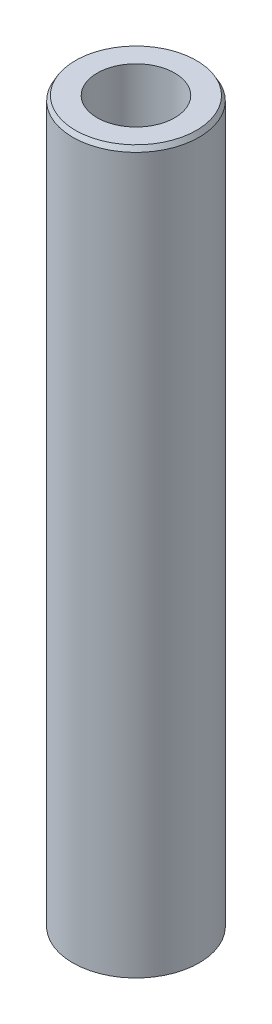
ISO-10303-21;
HEADER;
FILE_DESCRIPTION(('STEP AP214'),'2;1');
FILE_NAME('part.step','',(''),(''),'','','');
FILE_SCHEMA(('AUTOMOTIVE_DESIGN { 1 0 10303 214 1 1 1 1 }'));
ENDSEC;
DATA;
#1=APPLICATION_CONTEXT('core data for automotive mechanical design processes');
#2=APPLICATION_PROTOCOL_DEFINITION('international standard','automotive_design',2000,#1);
#3=PRODUCT_CONTEXT('',#1,'mechanical');
#4=PRODUCT('Part','Part','',(#3));
#5=PRODUCT_RELATED_PRODUCT_CATEGORY('part','',(#4));
#6=PRODUCT_DEFINITION_FORMATION('','',#4);
#7=PRODUCT_DEFINITION_CONTEXT('part definition',#1,'design');
#8=PRODUCT_DEFINITION('design','',#6,#7);
#9=PRODUCT_DEFINITION_SHAPE('','',#8);
#10=(LENGTH_UNIT() NAMED_UNIT(*) SI_UNIT(.MILLI.,.METRE.));
#11=(NAMED_UNIT(*) PLANE_ANGLE_UNIT() SI_UNIT($,.RADIAN.));
#12=(NAMED_UNIT(*) SI_UNIT($,.STERADIAN.) SOLID_ANGLE_UNIT());
#13=UNCERTAINTY_MEASURE_WITH_UNIT(LENGTH_MEASURE(1.E-05),#10,'distance_accuracy_value','');
#14=(GEOMETRIC_REPRESENTATION_CONTEXT(3) GLOBAL_UNCERTAINTY_ASSIGNED_CONTEXT((#13)) GLOBAL_UNIT_ASSIGNED_CONTEXT((#10,
#11,#12)) REPRESENTATION_CONTEXT('',''));
#15=CARTESIAN_POINT('',(0.,0.,0.));
#16=DIRECTION('',(0.,0.,1.));
#17=DIRECTION('',(1.,0.,0.));
#18=AXIS2_PLACEMENT_3D('',#15,#16,#17);
#19=CARTESIAN_POINT('',(0.,600.,0.));
#20=DIRECTION('',(0.,-1.,0.));
#21=DIRECTION('',(0.,0.,-1.));
#22=AXIS2_PLACEMENT_3D('',#19,#20,#21);
#23=CYLINDRICAL_SURFACE('',#22,52.5);
#24=CARTESIAN_POINT('',(0.,596.135225876518,0.));
#25=DIRECTION('',(0.,1.,0.));
#26=DIRECTION('',(0.,0.,1.));
#27=AXIS2_PLACEMENT_3D('',#24,#25,#26);
#28=CIRCLE('',#27,52.5);
#29=CARTESIAN_POINT('',(0.,596.135225876518,52.5));
#30=VERTEX_POINT('',#29);
#31=EDGE_CURVE('E50',#30,#30,#28,.F.);
#32=ORIENTED_EDGE('',*,*,#31,.T.);
#33=EDGE_LOOP('',(#32));
#34=FACE_BOUND('',#33,.T.);
#35=CARTESIAN_POINT('',(0.,2.23132838054907,0.));
#36=DIRECTION('',(0.,1.,0.));
#37=DIRECTION('',(0.,0.,1.));
#38=AXIS2_PLACEMENT_3D('',#35,#36,#37);
#39=CIRCLE('',#38,52.5);
#40=CARTESIAN_POINT('',(0.,2.23132838054907,52.5));
#41=VERTEX_POINT('',#40);
#42=EDGE_CURVE('E51',#41,#41,#39,.T.);
#43=ORIENTED_EDGE('',*,*,#42,.T.);
#44=EDGE_LOOP('',(#43));
#45=FACE_BOUND('',#44,.T.);
#46=ADVANCED_FACE('F39',(#34,#45),#23,.T.);
#47=CARTESIAN_POINT('',(0.,600.,0.));
#48=DIRECTION('',(0.,1.,0.));
#49=DIRECTION('',(0.,0.,1.));
#50=AXIS2_PLACEMENT_3D('',#47,#48,#49);
#51=PLANE('',#50);
#52=CARTESIAN_POINT('',(0.,600.,0.));
#53=DIRECTION('',(0.,1.,0.));
#54=DIRECTION('',(0.,0.,1.));
#55=AXIS2_PLACEMENT_3D('',#52,#53,#54);
#56=CIRCLE('',#55,50.2686716194507);
#57=CARTESIAN_POINT('',(0.,600.,50.2686716194507));
#58=VERTEX_POINT('',#57);
#59=EDGE_CURVE('E54',#58,#58,#56,.T.);
#60=ORIENTED_EDGE('',*,*,#59,.T.);
#61=EDGE_LOOP('',(#60));
#62=FACE_BOUND('',#61,.T.);
#63=CARTESIAN_POINT('',(0.,600.,0.));
#64=DIRECTION('',(0.,1.,0.));
#65=DIRECTION('',(0.,0.,1.));
#66=AXIS2_PLACEMENT_3D('',#63,#64,#65);
#67=CIRCLE('',#66,32.1978204312982);
#68=CARTESIAN_POINT('',(0.,600.,32.1978204312982));
#69=VERTEX_POINT('',#68);
#70=EDGE_CURVE('E58',#69,#69,#67,.T.);
#71=ORIENTED_EDGE('',*,*,#70,.F.);
#72=EDGE_LOOP('',(#71));
#73=FACE_BOUND('',#72,.T.);
#74=ADVANCED_FACE('F69',(#62,#73),#51,.T.);
#75=CARTESIAN_POINT('',(0.,0.,0.));
#76=DIRECTION('',(0.,1.,0.));
#77=DIRECTION('',(0.,0.,1.));
#78=AXIS2_PLACEMENT_3D('',#75,#76,#77);
#79=PLANE('',#78);
#80=CARTESIAN_POINT('',(0.,0.,0.));
#81=DIRECTION('',(0.,1.,0.));
#82=DIRECTION('',(0.,0.,1.));
#83=AXIS2_PLACEMENT_3D('',#80,#81,#82);
#84=CIRCLE('',#83,48.6352258765185);
#85=CARTESIAN_POINT('',(0.,0.,48.6352258765185));
#86=VERTEX_POINT('',#85);
#87=EDGE_CURVE('E10',#86,#86,#84,.F.);
#88=ORIENTED_EDGE('',*,*,#87,.T.);
#89=EDGE_LOOP('',(#88));
#90=FACE_BOUND('',#89,.T.);
#91=CARTESIAN_POINT('',(0.,0.,0.));
#92=DIRECTION('',(0.,1.,0.));
#93=DIRECTION('',(0.,0.,1.));
#94=AXIS2_PLACEMENT_3D('',#91,#92,#93);
#95=CIRCLE('',#94,32.1978204312982);
#96=CARTESIAN_POINT('',(0.,0.,32.1978204312982));
#97=VERTEX_POINT('',#96);
#98=EDGE_CURVE('E63',#97,#97,#95,.T.);
#99=ORIENTED_EDGE('',*,*,#98,.T.);
#100=EDGE_LOOP('',(#99));
#101=FACE_BOUND('',#100,.T.);
#102=ADVANCED_FACE('F75',(#90,#101),#79,.F.);
#103=CARTESIAN_POINT('',(0.,600.,0.));
#104=DIRECTION('',(0.,-1.,0.));
#105=DIRECTION('',(0.,0.,-1.));
#106=AXIS2_PLACEMENT_3D('',#103,#104,#105);
#107=CYLINDRICAL_SURFACE('',#106,32.1978204312982);
#108=ORIENTED_EDGE('',*,*,#70,.T.);
#109=EDGE_LOOP('',(#108));
#110=FACE_BOUND('',#109,.T.);
#111=ORIENTED_EDGE('',*,*,#98,.F.);
#112=EDGE_LOOP('',(#111));
#113=FACE_BOUND('',#112,.T.);
#114=ADVANCED_FACE('F70',(#110,#113),#107,.F.);
#115=CARTESIAN_POINT('',(0.,600.,0.));
#116=DIRECTION('',(0.,-1.,0.));
#117=DIRECTION('',(0.,0.,-1.));
#118=AXIS2_PLACEMENT_3D('',#115,#116,#117);
#119=CONICAL_SURFACE('',#118,50.2686716194507,0.523598775598289);
#120=ORIENTED_EDGE('',*,*,#31,.F.);
#121=EDGE_LOOP('',(#120));
#122=FACE_BOUND('',#121,.T.);
#123=ORIENTED_EDGE('',*,*,#59,.F.);
#124=EDGE_LOOP('',(#123));
#125=FACE_BOUND('',#124,.T.);
#126=ADVANCED_FACE('F81',(#122,#125),#119,.T.);
#127=CARTESIAN_POINT('',(0.,2.23132838054907,0.));
#128=DIRECTION('',(0.,1.,0.));
#129=DIRECTION('',(0.,0.,1.));
#130=AXIS2_PLACEMENT_3D('',#127,#128,#129);
#131=CONICAL_SURFACE('',#130,52.5,1.04719755119661);
#132=ORIENTED_EDGE('',*,*,#87,.F.);
#133=EDGE_LOOP('',(#132));
#134=FACE_BOUND('',#133,.T.);
#135=ORIENTED_EDGE('',*,*,#42,.F.);
#136=EDGE_LOOP('',(#135));
#137=FACE_BOUND('',#136,.T.);
#138=ADVANCED_FACE('F45',(#134,#137),#131,.T.);
#139=CLOSED_SHELL('',(#46,#74,#102,#114,#126,#138));
#140=MANIFOLD_SOLID_BREP('B2',#139);
#141=ADVANCED_BREP_SHAPE_REPRESENTATION('',(#18,#140),#14);
#142=SHAPE_DEFINITION_REPRESENTATION(#9,#141);
ENDSEC;
END-ISO-10303-21;
